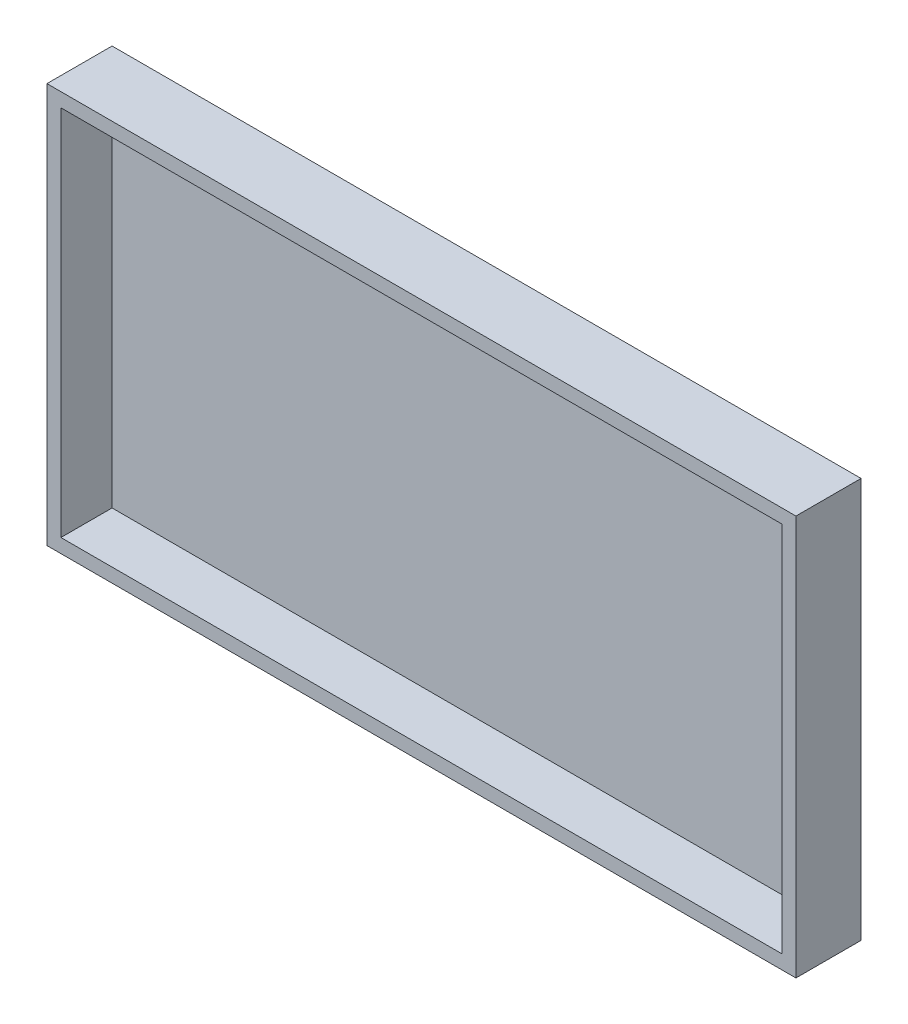
ISO-10303-21;
HEADER;
FILE_DESCRIPTION(('STEP AP214'),'2;1');
FILE_NAME('part.step','',(''),(''),'','','');
FILE_SCHEMA(('AUTOMOTIVE_DESIGN { 1 0 10303 214 1 1 1 1 }'));
ENDSEC;
DATA;
#1=APPLICATION_CONTEXT('core data for automotive mechanical design processes');
#2=APPLICATION_PROTOCOL_DEFINITION('international standard','automotive_design',2000,#1);
#3=PRODUCT_CONTEXT('',#1,'mechanical');
#4=PRODUCT('Part','Part','',(#3));
#5=PRODUCT_RELATED_PRODUCT_CATEGORY('part','',(#4));
#6=PRODUCT_DEFINITION_FORMATION('','',#4);
#7=PRODUCT_DEFINITION_CONTEXT('part definition',#1,'design');
#8=PRODUCT_DEFINITION('design','',#6,#7);
#9=PRODUCT_DEFINITION_SHAPE('','',#8);
#10=(LENGTH_UNIT() NAMED_UNIT(*) SI_UNIT(.MILLI.,.METRE.));
#11=(NAMED_UNIT(*) PLANE_ANGLE_UNIT() SI_UNIT($,.RADIAN.));
#12=(NAMED_UNIT(*) SI_UNIT($,.STERADIAN.) SOLID_ANGLE_UNIT());
#13=UNCERTAINTY_MEASURE_WITH_UNIT(LENGTH_MEASURE(1.E-05),#10,'distance_accuracy_value','');
#14=(GEOMETRIC_REPRESENTATION_CONTEXT(3) GLOBAL_UNCERTAINTY_ASSIGNED_CONTEXT((#13)) GLOBAL_UNIT_ASSIGNED_CONTEXT((#10,
#11,#12)) REPRESENTATION_CONTEXT('',''));
#15=CARTESIAN_POINT('',(0.,0.,0.));
#16=DIRECTION('',(0.,0.,1.));
#17=DIRECTION('',(1.,0.,0.));
#18=AXIS2_PLACEMENT_3D('',#15,#16,#17);
#19=CARTESIAN_POINT('',(-59.7768767221488,24.8877551020408,14.));
#20=DIRECTION('',(1.,0.,0.));
#21=DIRECTION('',(0.,1.,0.));
#22=AXIS2_PLACEMENT_3D('',#19,#20,#21);
#23=PLANE('',#22);
#24=DIRECTION('',(0.,-1.,0.));
#25=VECTOR('',#24,1.);
#26=CARTESIAN_POINT('',(-59.7768767221488,24.8877551020408,0.));
#27=LINE('',#26,#25);
#28=CARTESIAN_POINT('',(-59.7768767221488,24.8877551020408,0.));
#29=VERTEX_POINT('',#28);
#30=CARTESIAN_POINT('',(-59.7768767221487,-61.1122448979592,0.));
#31=VERTEX_POINT('',#30);
#32=EDGE_CURVE('E158',#29,#31,#27,.T.);
#33=ORIENTED_EDGE('',*,*,#32,.T.);
#34=DIRECTION('',(0.,0.,-1.));
#35=VECTOR('',#34,1.);
#36=CARTESIAN_POINT('',(-59.7768767221487,-61.1122448979592,14.));
#37=LINE('',#36,#35);
#38=CARTESIAN_POINT('',(-59.7768767221487,-61.1122448979592,14.));
#39=VERTEX_POINT('',#38);
#40=EDGE_CURVE('E11',#39,#31,#37,.T.);
#41=ORIENTED_EDGE('',*,*,#40,.F.);
#42=DIRECTION('',(0.,-1.,0.));
#43=VECTOR('',#42,1.);
#44=CARTESIAN_POINT('',(-59.7768767221488,24.8877551020408,14.));
#45=LINE('',#44,#43);
#46=CARTESIAN_POINT('',(-59.7768767221488,24.8877551020408,14.));
#47=VERTEX_POINT('',#46);
#48=EDGE_CURVE('E164',#47,#39,#45,.T.);
#49=ORIENTED_EDGE('',*,*,#48,.F.);
#50=DIRECTION('',(0.,0.,-1.));
#51=VECTOR('',#50,1.);
#52=CARTESIAN_POINT('',(-59.7768767221488,24.8877551020408,14.));
#53=LINE('',#52,#51);
#54=EDGE_CURVE('E174',#47,#29,#53,.T.);
#55=ORIENTED_EDGE('',*,*,#54,.T.);
#56=EDGE_LOOP('',(#33,#41,#49,#55));
#57=FACE_BOUND('',#56,.T.);
#58=ADVANCED_FACE('F39',(#57),#23,.F.);
#59=CARTESIAN_POINT('',(-59.7768767221487,-61.1122448979592,14.));
#60=DIRECTION('',(0.,1.,0.));
#61=DIRECTION('',(0.,0.,1.));
#62=AXIS2_PLACEMENT_3D('',#59,#60,#61);
#63=PLANE('',#62);
#64=DIRECTION('',(1.,0.,0.));
#65=VECTOR('',#64,1.);
#66=CARTESIAN_POINT('',(-59.7768767221487,-61.1122448979592,0.));
#67=LINE('',#66,#65);
#68=CARTESIAN_POINT('',(101.223123277851,-61.1122448979592,0.));
#69=VERTEX_POINT('',#68);
#70=EDGE_CURVE('E178',#31,#69,#67,.T.);
#71=ORIENTED_EDGE('',*,*,#70,.T.);
#72=DIRECTION('',(0.,0.,-1.));
#73=VECTOR('',#72,1.);
#74=CARTESIAN_POINT('',(101.223123277851,-61.1122448979592,14.));
#75=LINE('',#74,#73);
#76=CARTESIAN_POINT('',(101.223123277851,-61.1122448979592,14.));
#77=VERTEX_POINT('',#76);
#78=EDGE_CURVE('E47',#77,#69,#75,.T.);
#79=ORIENTED_EDGE('',*,*,#78,.F.);
#80=DIRECTION('',(1.,0.,0.));
#81=VECTOR('',#80,1.);
#82=CARTESIAN_POINT('',(-59.7768767221487,-61.1122448979592,14.));
#83=LINE('',#82,#81);
#84=EDGE_CURVE('E91',#39,#77,#83,.T.);
#85=ORIENTED_EDGE('',*,*,#84,.F.);
#86=ORIENTED_EDGE('',*,*,#40,.T.);
#87=EDGE_LOOP('',(#71,#79,#85,#86));
#88=FACE_BOUND('',#87,.T.);
#89=ADVANCED_FACE('F213',(#88),#63,.F.);
#90=CARTESIAN_POINT('',(101.223123277851,24.8877551020408,14.));
#91=DIRECTION('',(-1.,0.,0.));
#92=DIRECTION('',(0.,-1.,0.));
#93=AXIS2_PLACEMENT_3D('',#90,#91,#92);
#94=PLANE('',#93);
#95=DIRECTION('',(0.,1.,0.));
#96=VECTOR('',#95,1.);
#97=CARTESIAN_POINT('',(101.223123277851,24.8877551020408,0.));
#98=LINE('',#97,#96);
#99=CARTESIAN_POINT('',(101.223123277851,24.8877551020408,0.));
#100=VERTEX_POINT('',#99);
#101=EDGE_CURVE('E181',#69,#100,#98,.T.);
#102=ORIENTED_EDGE('',*,*,#101,.T.);
#103=DIRECTION('',(0.,0.,-1.));
#104=VECTOR('',#103,1.);
#105=CARTESIAN_POINT('',(101.223123277851,24.8877551020408,14.));
#106=LINE('',#105,#104);
#107=CARTESIAN_POINT('',(101.223123277851,24.8877551020408,14.));
#108=VERTEX_POINT('',#107);
#109=EDGE_CURVE('E188',#108,#100,#106,.T.);
#110=ORIENTED_EDGE('',*,*,#109,.F.);
#111=DIRECTION('',(0.,1.,0.));
#112=VECTOR('',#111,1.);
#113=CARTESIAN_POINT('',(101.223123277851,24.8877551020408,14.));
#114=LINE('',#113,#112);
#115=EDGE_CURVE('E169',#77,#108,#114,.T.);
#116=ORIENTED_EDGE('',*,*,#115,.F.);
#117=ORIENTED_EDGE('',*,*,#78,.T.);
#118=EDGE_LOOP('',(#102,#110,#116,#117));
#119=FACE_BOUND('',#118,.T.);
#120=ADVANCED_FACE('F195',(#119),#94,.F.);
#121=CARTESIAN_POINT('',(-59.7768767221488,24.8877551020408,14.));
#122=DIRECTION('',(0.,-1.,0.));
#123=DIRECTION('',(0.,0.,-1.));
#124=AXIS2_PLACEMENT_3D('',#121,#122,#123);
#125=PLANE('',#124);
#126=DIRECTION('',(-1.,0.,0.));
#127=VECTOR('',#126,1.);
#128=CARTESIAN_POINT('',(-59.7768767221488,24.8877551020408,0.));
#129=LINE('',#128,#127);
#130=EDGE_CURVE('E84',#100,#29,#129,.T.);
#131=ORIENTED_EDGE('',*,*,#130,.T.);
#132=ORIENTED_EDGE('',*,*,#54,.F.);
#133=DIRECTION('',(-1.,0.,0.));
#134=VECTOR('',#133,1.);
#135=CARTESIAN_POINT('',(-59.7768767221488,24.8877551020408,14.));
#136=LINE('',#135,#134);
#137=EDGE_CURVE('E63',#108,#47,#136,.T.);
#138=ORIENTED_EDGE('',*,*,#137,.F.);
#139=ORIENTED_EDGE('',*,*,#109,.T.);
#140=EDGE_LOOP('',(#131,#132,#138,#139));
#141=FACE_BOUND('',#140,.T.);
#142=ADVANCED_FACE('F203',(#141),#125,.F.);
#143=CARTESIAN_POINT('',(0.,0.,14.));
#144=DIRECTION('',(0.,0.,1.));
#145=DIRECTION('',(1.,0.,0.));
#146=AXIS2_PLACEMENT_3D('',#143,#144,#145);
#147=PLANE('',#146);
#148=DIRECTION('',(0.,-1.,0.));
#149=VECTOR('',#148,1.);
#150=CARTESIAN_POINT('',(-56.7768767221488,21.8877551020408,14.));
#151=LINE('',#150,#149);
#152=CARTESIAN_POINT('',(-56.7768767221488,21.8877551020408,14.));
#153=VERTEX_POINT('',#152);
#154=CARTESIAN_POINT('',(-56.7768767221488,-58.1122448979592,14.));
#155=VERTEX_POINT('',#154);
#156=EDGE_CURVE('E54',#153,#155,#151,.T.);
#157=ORIENTED_EDGE('',*,*,#156,.F.);
#158=DIRECTION('',(-1.,0.,0.));
#159=VECTOR('',#158,1.);
#160=CARTESIAN_POINT('',(-56.7768767221488,21.8877551020408,14.));
#161=LINE('',#160,#159);
#162=CARTESIAN_POINT('',(98.2231232778512,21.8877551020408,14.));
#163=VERTEX_POINT('',#162);
#164=EDGE_CURVE('E136',#163,#153,#161,.T.);
#165=ORIENTED_EDGE('',*,*,#164,.F.);
#166=DIRECTION('',(0.,1.,0.));
#167=VECTOR('',#166,1.);
#168=CARTESIAN_POINT('',(98.2231232778512,21.8877551020408,14.));
#169=LINE('',#168,#167);
#170=CARTESIAN_POINT('',(98.2231232778512,-58.1122448979592,14.));
#171=VERTEX_POINT('',#170);
#172=EDGE_CURVE('E140',#171,#163,#169,.T.);
#173=ORIENTED_EDGE('',*,*,#172,.F.);
#174=DIRECTION('',(1.,0.,0.));
#175=VECTOR('',#174,1.);
#176=CARTESIAN_POINT('',(-56.7768767221488,-58.1122448979592,14.));
#177=LINE('',#176,#175);
#178=EDGE_CURVE('E149',#155,#171,#177,.T.);
#179=ORIENTED_EDGE('',*,*,#178,.F.);
#180=EDGE_LOOP('',(#157,#165,#173,#179));
#181=FACE_BOUND('',#180,.T.);
#182=ORIENTED_EDGE('',*,*,#48,.T.);
#183=ORIENTED_EDGE('',*,*,#84,.T.);
#184=ORIENTED_EDGE('',*,*,#115,.T.);
#185=ORIENTED_EDGE('',*,*,#137,.T.);
#186=EDGE_LOOP('',(#182,#183,#184,#185));
#187=FACE_BOUND('',#186,.T.);
#188=ADVANCED_FACE('F205',(#181,#187),#147,.T.);
#189=CARTESIAN_POINT('',(0.,0.,0.));
#190=DIRECTION('',(0.,0.,1.));
#191=DIRECTION('',(1.,0.,0.));
#192=AXIS2_PLACEMENT_3D('',#189,#190,#191);
#193=PLANE('',#192);
#194=ORIENTED_EDGE('',*,*,#32,.F.);
#195=ORIENTED_EDGE('',*,*,#130,.F.);
#196=ORIENTED_EDGE('',*,*,#101,.F.);
#197=ORIENTED_EDGE('',*,*,#70,.F.);
#198=EDGE_LOOP('',(#194,#195,#196,#197));
#199=FACE_BOUND('',#198,.T.);
#200=ADVANCED_FACE('F199',(#199),#193,.F.);
#201=CARTESIAN_POINT('',(-56.7768767221488,21.8877551020408,3.));
#202=DIRECTION('',(-1.,0.,0.));
#203=DIRECTION('',(0.,-1.,0.));
#204=AXIS2_PLACEMENT_3D('',#201,#202,#203);
#205=PLANE('',#204);
#206=ORIENTED_EDGE('',*,*,#156,.T.);
#207=DIRECTION('',(0.,0.,1.));
#208=VECTOR('',#207,1.);
#209=CARTESIAN_POINT('',(-56.7768767221488,-58.1122448979592,3.));
#210=LINE('',#209,#208);
#211=CARTESIAN_POINT('',(-56.7768767221488,-58.1122448979592,3.));
#212=VERTEX_POINT('',#211);
#213=EDGE_CURVE('E111',#212,#155,#210,.T.);
#214=ORIENTED_EDGE('',*,*,#213,.F.);
#215=DIRECTION('',(0.,-1.,0.));
#216=VECTOR('',#215,1.);
#217=CARTESIAN_POINT('',(-56.7768767221488,21.8877551020408,3.));
#218=LINE('',#217,#216);
#219=CARTESIAN_POINT('',(-56.7768767221488,21.8877551020408,3.));
#220=VERTEX_POINT('',#219);
#221=EDGE_CURVE('E115',#220,#212,#218,.T.);
#222=ORIENTED_EDGE('',*,*,#221,.F.);
#223=DIRECTION('',(0.,0.,1.));
#224=VECTOR('',#223,1.);
#225=CARTESIAN_POINT('',(-56.7768767221488,21.8877551020408,3.));
#226=LINE('',#225,#224);
#227=EDGE_CURVE('E155',#220,#153,#226,.T.);
#228=ORIENTED_EDGE('',*,*,#227,.T.);
#229=EDGE_LOOP('',(#206,#214,#222,#228));
#230=FACE_BOUND('',#229,.T.);
#231=ADVANCED_FACE('F113',(#230),#205,.F.);
#232=CARTESIAN_POINT('',(-56.7768767221488,21.8877551020408,3.));
#233=DIRECTION('',(0.,1.,0.));
#234=DIRECTION('',(0.,0.,1.));
#235=AXIS2_PLACEMENT_3D('',#232,#233,#234);
#236=PLANE('',#235);
#237=ORIENTED_EDGE('',*,*,#164,.T.);
#238=ORIENTED_EDGE('',*,*,#227,.F.);
#239=DIRECTION('',(-1.,0.,0.));
#240=VECTOR('',#239,1.);
#241=CARTESIAN_POINT('',(-56.7768767221488,21.8877551020408,3.));
#242=LINE('',#241,#240);
#243=CARTESIAN_POINT('',(98.2231232778512,21.8877551020408,3.));
#244=VERTEX_POINT('',#243);
#245=EDGE_CURVE('E122',#244,#220,#242,.T.);
#246=ORIENTED_EDGE('',*,*,#245,.F.);
#247=DIRECTION('',(0.,0.,1.));
#248=VECTOR('',#247,1.);
#249=CARTESIAN_POINT('',(98.2231232778512,21.8877551020408,3.));
#250=LINE('',#249,#248);
#251=EDGE_CURVE('E159',#244,#163,#250,.T.);
#252=ORIENTED_EDGE('',*,*,#251,.T.);
#253=EDGE_LOOP('',(#237,#238,#246,#252));
#254=FACE_BOUND('',#253,.T.);
#255=ADVANCED_FACE('F252',(#254),#236,.F.);
#256=CARTESIAN_POINT('',(98.2231232778512,21.8877551020408,3.));
#257=DIRECTION('',(1.,0.,0.));
#258=DIRECTION('',(0.,1.,0.));
#259=AXIS2_PLACEMENT_3D('',#256,#257,#258);
#260=PLANE('',#259);
#261=ORIENTED_EDGE('',*,*,#172,.T.);
#262=ORIENTED_EDGE('',*,*,#251,.F.);
#263=DIRECTION('',(0.,1.,0.));
#264=VECTOR('',#263,1.);
#265=CARTESIAN_POINT('',(98.2231232778512,21.8877551020408,3.));
#266=LINE('',#265,#264);
#267=CARTESIAN_POINT('',(98.2231232778512,-58.1122448979592,3.));
#268=VERTEX_POINT('',#267);
#269=EDGE_CURVE('E131',#268,#244,#266,.T.);
#270=ORIENTED_EDGE('',*,*,#269,.F.);
#271=DIRECTION('',(0.,0.,1.));
#272=VECTOR('',#271,1.);
#273=CARTESIAN_POINT('',(98.2231232778512,-58.1122448979592,3.));
#274=LINE('',#273,#272);
#275=EDGE_CURVE('E121',#268,#171,#274,.T.);
#276=ORIENTED_EDGE('',*,*,#275,.T.);
#277=EDGE_LOOP('',(#261,#262,#270,#276));
#278=FACE_BOUND('',#277,.T.);
#279=ADVANCED_FACE('F261',(#278),#260,.F.);
#280=CARTESIAN_POINT('',(-56.7768767221488,-58.1122448979592,3.));
#281=DIRECTION('',(0.,-1.,0.));
#282=DIRECTION('',(0.,0.,-1.));
#283=AXIS2_PLACEMENT_3D('',#280,#281,#282);
#284=PLANE('',#283);
#285=ORIENTED_EDGE('',*,*,#178,.T.);
#286=ORIENTED_EDGE('',*,*,#275,.F.);
#287=DIRECTION('',(1.,0.,0.));
#288=VECTOR('',#287,1.);
#289=CARTESIAN_POINT('',(-56.7768767221488,-58.1122448979592,3.));
#290=LINE('',#289,#288);
#291=EDGE_CURVE('E125',#212,#268,#290,.T.);
#292=ORIENTED_EDGE('',*,*,#291,.F.);
#293=ORIENTED_EDGE('',*,*,#213,.T.);
#294=EDGE_LOOP('',(#285,#286,#292,#293));
#295=FACE_BOUND('',#294,.T.);
#296=ADVANCED_FACE('F126',(#295),#284,.F.);
#297=CARTESIAN_POINT('',(0.,0.,3.));
#298=DIRECTION('',(0.,0.,1.));
#299=DIRECTION('',(1.,0.,0.));
#300=AXIS2_PLACEMENT_3D('',#297,#298,#299);
#301=PLANE('',#300);
#302=ORIENTED_EDGE('',*,*,#221,.T.);
#303=ORIENTED_EDGE('',*,*,#291,.T.);
#304=ORIENTED_EDGE('',*,*,#269,.T.);
#305=ORIENTED_EDGE('',*,*,#245,.T.);
#306=EDGE_LOOP('',(#302,#303,#304,#305));
#307=FACE_BOUND('',#306,.T.);
#308=ADVANCED_FACE('F133',(#307),#301,.T.);
#309=CLOSED_SHELL('',(#58,#89,#120,#142,#188,#200,#231,#255,#279,#296,#308));
#310=MANIFOLD_SOLID_BREP('B2',#309);
#311=ADVANCED_BREP_SHAPE_REPRESENTATION('',(#18,#310),#14);
#312=SHAPE_DEFINITION_REPRESENTATION(#9,#311);
ENDSEC;
END-ISO-10303-21;
